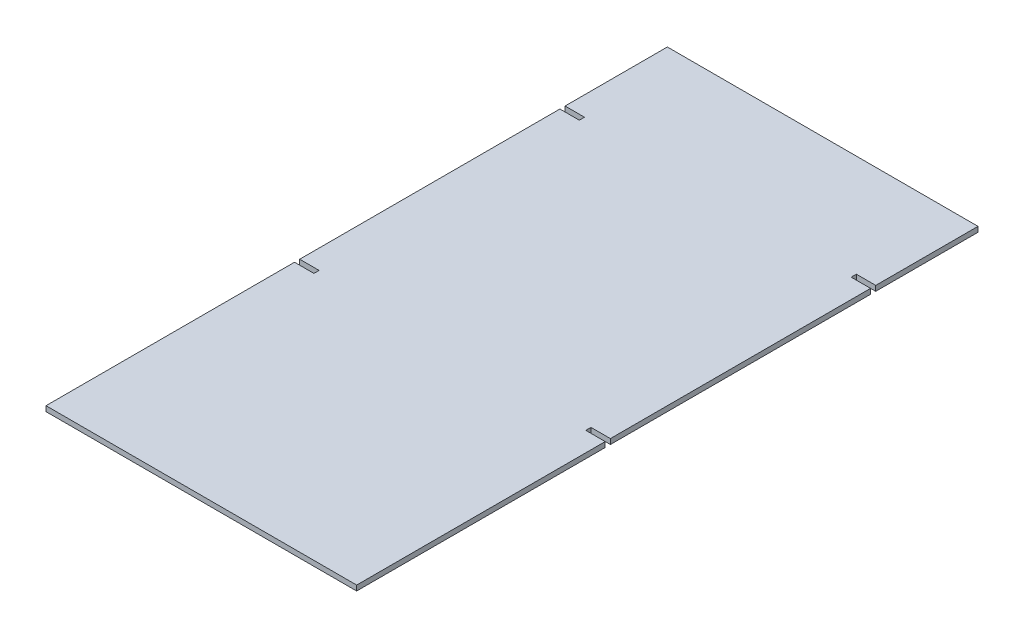
ISO-10303-21;
HEADER;
FILE_DESCRIPTION(('STEP AP214'),'2;1');
FILE_NAME('part.step','',(''),(''),'','','');
FILE_SCHEMA(('AUTOMOTIVE_DESIGN { 1 0 10303 214 1 1 1 1 }'));
ENDSEC;
DATA;
#1=APPLICATION_CONTEXT('core data for automotive mechanical design processes');
#2=APPLICATION_PROTOCOL_DEFINITION('international standard','automotive_design',2000,#1);
#3=PRODUCT_CONTEXT('',#1,'mechanical');
#4=PRODUCT('Part','Part','',(#3));
#5=PRODUCT_RELATED_PRODUCT_CATEGORY('part','',(#4));
#6=PRODUCT_DEFINITION_FORMATION('','',#4);
#7=PRODUCT_DEFINITION_CONTEXT('part definition',#1,'design');
#8=PRODUCT_DEFINITION('design','',#6,#7);
#9=PRODUCT_DEFINITION_SHAPE('','',#8);
#10=(LENGTH_UNIT() NAMED_UNIT(*) SI_UNIT(.MILLI.,.METRE.));
#11=(NAMED_UNIT(*) PLANE_ANGLE_UNIT() SI_UNIT($,.RADIAN.));
#12=(NAMED_UNIT(*) SI_UNIT($,.STERADIAN.) SOLID_ANGLE_UNIT());
#13=UNCERTAINTY_MEASURE_WITH_UNIT(LENGTH_MEASURE(1.E-05),#10,'distance_accuracy_value','');
#14=(GEOMETRIC_REPRESENTATION_CONTEXT(3) GLOBAL_UNCERTAINTY_ASSIGNED_CONTEXT((#13)) GLOBAL_UNIT_ASSIGNED_CONTEXT((#10,
#11,#12)) REPRESENTATION_CONTEXT('',''));
#15=CARTESIAN_POINT('',(0.,0.,0.));
#16=DIRECTION('',(0.,0.,1.));
#17=DIRECTION('',(1.,0.,0.));
#18=AXIS2_PLACEMENT_3D('',#15,#16,#17);
#19=CARTESIAN_POINT('',(152.4,5.08,304.8));
#20=DIRECTION('',(-1.,0.,0.));
#21=DIRECTION('',(0.,0.,1.));
#22=AXIS2_PLACEMENT_3D('',#19,#20,#21);
#23=PLANE('',#22);
#24=DIRECTION('',(0.,0.,-1.));
#25=VECTOR('',#24,1.);
#26=CARTESIAN_POINT('',(152.4,0.,304.8));
#27=LINE('',#26,#25);
#28=CARTESIAN_POINT('',(152.4,0.,55.88));
#29=VERTEX_POINT('',#28);
#30=CARTESIAN_POINT('',(152.4,0.,-199.39));
#31=VERTEX_POINT('',#30);
#32=EDGE_CURVE('E195',#29,#31,#27,.T.);
#33=ORIENTED_EDGE('',*,*,#32,.T.);
#34=DIRECTION('',(0.,1.,0.));
#35=VECTOR('',#34,1.);
#36=CARTESIAN_POINT('',(152.4,0.,-199.39));
#37=LINE('',#36,#35);
#38=CARTESIAN_POINT('',(152.4,5.08,-199.39));
#39=VERTEX_POINT('',#38);
#40=EDGE_CURVE('E299',#31,#39,#37,.T.);
#41=ORIENTED_EDGE('',*,*,#40,.T.);
#42=DIRECTION('',(0.,0.,-1.));
#43=VECTOR('',#42,1.);
#44=CARTESIAN_POINT('',(152.4,5.08,304.8));
#45=LINE('',#44,#43);
#46=CARTESIAN_POINT('',(152.4,5.08,55.88));
#47=VERTEX_POINT('',#46);
#48=EDGE_CURVE('E311',#47,#39,#45,.T.);
#49=ORIENTED_EDGE('',*,*,#48,.F.);
#50=DIRECTION('',(0.,1.,0.));
#51=VECTOR('',#50,1.);
#52=CARTESIAN_POINT('',(152.4,0.,55.88));
#53=LINE('',#52,#51);
#54=EDGE_CURVE('E294',#29,#47,#53,.T.);
#55=ORIENTED_EDGE('',*,*,#54,.F.);
#56=EDGE_LOOP('',(#33,#41,#49,#55));
#57=FACE_BOUND('',#56,.T.);
#58=ADVANCED_FACE('F33',(#57),#23,.F.);
#59=CARTESIAN_POINT('',(152.4,0.,304.8));
#60=VERTEX_POINT('',#59);
#61=CARTESIAN_POINT('',(152.4,0.,60.96));
#62=VERTEX_POINT('',#61);
#63=EDGE_CURVE('E198',#60,#62,#27,.T.);
#64=ORIENTED_EDGE('',*,*,#63,.T.);
#65=DIRECTION('',(0.,1.,0.));
#66=VECTOR('',#65,1.);
#67=CARTESIAN_POINT('',(152.4,0.,60.96));
#68=LINE('',#67,#66);
#69=CARTESIAN_POINT('',(152.4,5.08,60.96));
#70=VERTEX_POINT('',#69);
#71=EDGE_CURVE('E196',#62,#70,#68,.T.);
#72=ORIENTED_EDGE('',*,*,#71,.T.);
#73=CARTESIAN_POINT('',(152.4,5.08,304.8));
#74=VERTEX_POINT('',#73);
#75=EDGE_CURVE('E307',#74,#70,#45,.T.);
#76=ORIENTED_EDGE('',*,*,#75,.F.);
#77=DIRECTION('',(0.,-1.,0.));
#78=VECTOR('',#77,1.);
#79=CARTESIAN_POINT('',(152.4,5.08,304.8));
#80=LINE('',#79,#78);
#81=EDGE_CURVE('E220',#74,#60,#80,.T.);
#82=ORIENTED_EDGE('',*,*,#81,.T.);
#83=EDGE_LOOP('',(#64,#72,#76,#82));
#84=FACE_BOUND('',#83,.T.);
#85=ADVANCED_FACE('F327',(#84),#23,.F.);
#86=CARTESIAN_POINT('',(-152.4,5.08,304.8));
#87=DIRECTION('',(1.,0.,0.));
#88=DIRECTION('',(0.,0.,-1.));
#89=AXIS2_PLACEMENT_3D('',#86,#87,#88);
#90=PLANE('',#89);
#91=DIRECTION('',(0.,0.,1.));
#92=VECTOR('',#91,1.);
#93=CARTESIAN_POINT('',(-152.4,5.08,304.8));
#94=LINE('',#93,#92);
#95=CARTESIAN_POINT('',(-152.4,5.08,60.96));
#96=VERTEX_POINT('',#95);
#97=CARTESIAN_POINT('',(-152.4,5.08,304.8));
#98=VERTEX_POINT('',#97);
#99=EDGE_CURVE('E313',#96,#98,#94,.T.);
#100=ORIENTED_EDGE('',*,*,#99,.F.);
#101=DIRECTION('',(0.,1.,0.));
#102=VECTOR('',#101,1.);
#103=CARTESIAN_POINT('',(-152.4,0.,60.96));
#104=LINE('',#103,#102);
#105=CARTESIAN_POINT('',(-152.4,0.,60.96));
#106=VERTEX_POINT('',#105);
#107=EDGE_CURVE('E250',#106,#96,#104,.T.);
#108=ORIENTED_EDGE('',*,*,#107,.F.);
#109=DIRECTION('',(0.,0.,1.));
#110=VECTOR('',#109,1.);
#111=CARTESIAN_POINT('',(-152.4,0.,304.8));
#112=LINE('',#111,#110);
#113=CARTESIAN_POINT('',(-152.4,0.,304.8));
#114=VERTEX_POINT('',#113);
#115=EDGE_CURVE('E209',#106,#114,#112,.T.);
#116=ORIENTED_EDGE('',*,*,#115,.T.);
#117=DIRECTION('',(0.,-1.,0.));
#118=VECTOR('',#117,1.);
#119=CARTESIAN_POINT('',(-152.4,5.08,304.8));
#120=LINE('',#119,#118);
#121=EDGE_CURVE('E222',#98,#114,#120,.T.);
#122=ORIENTED_EDGE('',*,*,#121,.F.);
#123=EDGE_LOOP('',(#100,#108,#116,#122));
#124=FACE_BOUND('',#123,.T.);
#125=ADVANCED_FACE('F355',(#124),#90,.F.);
#126=CARTESIAN_POINT('',(-152.4,0.,-304.8));
#127=VERTEX_POINT('',#126);
#128=CARTESIAN_POINT('',(-152.4,0.,-204.47));
#129=VERTEX_POINT('',#128);
#130=EDGE_CURVE('E215',#127,#129,#112,.T.);
#131=ORIENTED_EDGE('',*,*,#130,.T.);
#132=DIRECTION('',(0.,1.,0.));
#133=VECTOR('',#132,1.);
#134=CARTESIAN_POINT('',(-152.4,0.,-204.47));
#135=LINE('',#134,#133);
#136=CARTESIAN_POINT('',(-152.4,5.08,-204.47));
#137=VERTEX_POINT('',#136);
#138=EDGE_CURVE('E247',#129,#137,#135,.T.);
#139=ORIENTED_EDGE('',*,*,#138,.T.);
#140=CARTESIAN_POINT('',(-152.4,5.08,-304.8));
#141=VERTEX_POINT('',#140);
#142=EDGE_CURVE('E230',#141,#137,#94,.T.);
#143=ORIENTED_EDGE('',*,*,#142,.F.);
#144=DIRECTION('',(0.,-1.,0.));
#145=VECTOR('',#144,1.);
#146=CARTESIAN_POINT('',(-152.4,5.08,-304.8));
#147=LINE('',#146,#145);
#148=EDGE_CURVE('E41',#141,#127,#147,.T.);
#149=ORIENTED_EDGE('',*,*,#148,.T.);
#150=EDGE_LOOP('',(#131,#139,#143,#149));
#151=FACE_BOUND('',#150,.T.);
#152=ADVANCED_FACE('F227',(#151),#90,.F.);
#153=CARTESIAN_POINT('',(152.4,5.08,-204.47));
#154=VERTEX_POINT('',#153);
#155=CARTESIAN_POINT('',(152.4,5.08,-304.8));
#156=VERTEX_POINT('',#155);
#157=EDGE_CURVE('E188',#154,#156,#45,.T.);
#158=ORIENTED_EDGE('',*,*,#157,.F.);
#159=DIRECTION('',(0.,1.,0.));
#160=VECTOR('',#159,1.);
#161=CARTESIAN_POINT('',(152.4,0.,-204.47));
#162=LINE('',#161,#160);
#163=CARTESIAN_POINT('',(152.4,0.,-204.47));
#164=VERTEX_POINT('',#163);
#165=EDGE_CURVE('E174',#164,#154,#162,.T.);
#166=ORIENTED_EDGE('',*,*,#165,.F.);
#167=CARTESIAN_POINT('',(152.4,0.,-304.8));
#168=VERTEX_POINT('',#167);
#169=EDGE_CURVE('E186',#164,#168,#27,.T.);
#170=ORIENTED_EDGE('',*,*,#169,.T.);
#171=DIRECTION('',(0.,-1.,0.));
#172=VECTOR('',#171,1.);
#173=CARTESIAN_POINT('',(152.4,5.08,-304.8));
#174=LINE('',#173,#172);
#175=EDGE_CURVE('E11',#156,#168,#174,.T.);
#176=ORIENTED_EDGE('',*,*,#175,.F.);
#177=EDGE_LOOP('',(#158,#166,#170,#176));
#178=FACE_BOUND('',#177,.T.);
#179=ADVANCED_FACE('F35',(#178),#23,.F.);
#180=CARTESIAN_POINT('',(152.4,5.08,-304.8));
#181=DIRECTION('',(0.,0.,1.));
#182=DIRECTION('',(1.,0.,0.));
#183=AXIS2_PLACEMENT_3D('',#180,#181,#182);
#184=PLANE('',#183);
#185=DIRECTION('',(-1.,0.,0.));
#186=VECTOR('',#185,1.);
#187=CARTESIAN_POINT('',(152.4,0.,-304.8));
#188=LINE('',#187,#186);
#189=EDGE_CURVE('E194',#168,#127,#188,.T.);
#190=ORIENTED_EDGE('',*,*,#189,.T.);
#191=ORIENTED_EDGE('',*,*,#148,.F.);
#192=DIRECTION('',(-1.,0.,0.));
#193=VECTOR('',#192,1.);
#194=CARTESIAN_POINT('',(152.4,5.08,-304.8));
#195=LINE('',#194,#193);
#196=EDGE_CURVE('E310',#156,#141,#195,.T.);
#197=ORIENTED_EDGE('',*,*,#196,.F.);
#198=ORIENTED_EDGE('',*,*,#175,.T.);
#199=EDGE_LOOP('',(#190,#191,#197,#198));
#200=FACE_BOUND('',#199,.T.);
#201=ADVANCED_FACE('F346',(#200),#184,.F.);
#202=CARTESIAN_POINT('',(-152.4,0.,-199.39));
#203=VERTEX_POINT('',#202);
#204=CARTESIAN_POINT('',(-152.4,0.,55.88));
#205=VERTEX_POINT('',#204);
#206=EDGE_CURVE('E213',#203,#205,#112,.T.);
#207=ORIENTED_EDGE('',*,*,#206,.T.);
#208=DIRECTION('',(0.,1.,0.));
#209=VECTOR('',#208,1.);
#210=CARTESIAN_POINT('',(-152.4,0.,55.88));
#211=LINE('',#210,#209);
#212=CARTESIAN_POINT('',(-152.4,5.08,55.88));
#213=VERTEX_POINT('',#212);
#214=EDGE_CURVE('E278',#205,#213,#211,.T.);
#215=ORIENTED_EDGE('',*,*,#214,.T.);
#216=CARTESIAN_POINT('',(-152.4,5.08,-199.39));
#217=VERTEX_POINT('',#216);
#218=EDGE_CURVE('E314',#217,#213,#94,.T.);
#219=ORIENTED_EDGE('',*,*,#218,.F.);
#220=DIRECTION('',(0.,1.,0.));
#221=VECTOR('',#220,1.);
#222=CARTESIAN_POINT('',(-152.4,0.,-199.39));
#223=LINE('',#222,#221);
#224=EDGE_CURVE('E258',#203,#217,#223,.T.);
#225=ORIENTED_EDGE('',*,*,#224,.F.);
#226=EDGE_LOOP('',(#207,#215,#219,#225));
#227=FACE_BOUND('',#226,.T.);
#228=ADVANCED_FACE('F348',(#227),#90,.F.);
#229=CARTESIAN_POINT('',(152.4,5.08,304.8));
#230=DIRECTION('',(0.,0.,-1.));
#231=DIRECTION('',(-1.,0.,0.));
#232=AXIS2_PLACEMENT_3D('',#229,#230,#231);
#233=PLANE('',#232);
#234=DIRECTION('',(1.,0.,0.));
#235=VECTOR('',#234,1.);
#236=CARTESIAN_POINT('',(152.4,0.,304.8));
#237=LINE('',#236,#235);
#238=EDGE_CURVE('E218',#114,#60,#237,.T.);
#239=ORIENTED_EDGE('',*,*,#238,.T.);
#240=ORIENTED_EDGE('',*,*,#81,.F.);
#241=DIRECTION('',(1.,0.,0.));
#242=VECTOR('',#241,1.);
#243=CARTESIAN_POINT('',(152.4,5.08,304.8));
#244=LINE('',#243,#242);
#245=EDGE_CURVE('E223',#98,#74,#244,.T.);
#246=ORIENTED_EDGE('',*,*,#245,.F.);
#247=ORIENTED_EDGE('',*,*,#121,.T.);
#248=EDGE_LOOP('',(#239,#240,#246,#247));
#249=FACE_BOUND('',#248,.T.);
#250=ADVANCED_FACE('F325',(#249),#233,.F.);
#251=CARTESIAN_POINT('',(0.,5.08,0.));
#252=DIRECTION('',(0.,1.,0.));
#253=DIRECTION('',(0.,0.,1.));
#254=AXIS2_PLACEMENT_3D('',#251,#252,#253);
#255=PLANE('',#254);
#256=DIRECTION('',(1.,0.,0.));
#257=VECTOR('',#256,1.);
#258=CARTESIAN_POINT('',(-152.4,5.08,60.96));
#259=LINE('',#258,#257);
#260=CARTESIAN_POINT('',(-133.35,5.08,60.96));
#261=VERTEX_POINT('',#260);
#262=EDGE_CURVE('E270',#96,#261,#259,.T.);
#263=ORIENTED_EDGE('',*,*,#262,.F.);
#264=ORIENTED_EDGE('',*,*,#99,.T.);
#265=ORIENTED_EDGE('',*,*,#245,.T.);
#266=ORIENTED_EDGE('',*,*,#75,.T.);
#267=DIRECTION('',(1.,0.,0.));
#268=VECTOR('',#267,1.);
#269=CARTESIAN_POINT('',(152.4,5.08,60.96));
#270=LINE('',#269,#268);
#271=CARTESIAN_POINT('',(133.35,5.08,60.96));
#272=VERTEX_POINT('',#271);
#273=EDGE_CURVE('E288',#272,#70,#270,.T.);
#274=ORIENTED_EDGE('',*,*,#273,.F.);
#275=DIRECTION('',(0.,0.,1.));
#276=VECTOR('',#275,1.);
#277=CARTESIAN_POINT('',(133.35,5.08,60.96));
#278=LINE('',#277,#276);
#279=CARTESIAN_POINT('',(133.35,5.08,55.88));
#280=VERTEX_POINT('',#279);
#281=EDGE_CURVE('E298',#280,#272,#278,.T.);
#282=ORIENTED_EDGE('',*,*,#281,.F.);
#283=DIRECTION('',(-1.,0.,0.));
#284=VECTOR('',#283,1.);
#285=CARTESIAN_POINT('',(152.4,5.08,55.88));
#286=LINE('',#285,#284);
#287=EDGE_CURVE('E295',#47,#280,#286,.T.);
#288=ORIENTED_EDGE('',*,*,#287,.F.);
#289=ORIENTED_EDGE('',*,*,#48,.T.);
#290=DIRECTION('',(1.,0.,0.));
#291=VECTOR('',#290,1.);
#292=CARTESIAN_POINT('',(152.4,5.08,-199.39));
#293=LINE('',#292,#291);
#294=CARTESIAN_POINT('',(133.35,5.08,-199.39));
#295=VERTEX_POINT('',#294);
#296=EDGE_CURVE('E181',#295,#39,#293,.T.);
#297=ORIENTED_EDGE('',*,*,#296,.F.);
#298=DIRECTION('',(0.,0.,1.));
#299=VECTOR('',#298,1.);
#300=CARTESIAN_POINT('',(133.35,5.08,-204.47));
#301=LINE('',#300,#299);
#302=CARTESIAN_POINT('',(133.35,5.08,-204.47));
#303=VERTEX_POINT('',#302);
#304=EDGE_CURVE('E416',#303,#295,#301,.T.);
#305=ORIENTED_EDGE('',*,*,#304,.F.);
#306=DIRECTION('',(-1.,0.,0.));
#307=VECTOR('',#306,1.);
#308=CARTESIAN_POINT('',(152.4,5.08,-204.47));
#309=LINE('',#308,#307);
#310=EDGE_CURVE('E255',#154,#303,#309,.T.);
#311=ORIENTED_EDGE('',*,*,#310,.F.);
#312=ORIENTED_EDGE('',*,*,#157,.T.);
#313=ORIENTED_EDGE('',*,*,#196,.T.);
#314=ORIENTED_EDGE('',*,*,#142,.T.);
#315=DIRECTION('',(-1.,0.,0.));
#316=VECTOR('',#315,1.);
#317=CARTESIAN_POINT('',(-152.4,5.08,-204.47));
#318=LINE('',#317,#316);
#319=CARTESIAN_POINT('',(-133.35,5.08,-204.47));
#320=VERTEX_POINT('',#319);
#321=EDGE_CURVE('E248',#320,#137,#318,.T.);
#322=ORIENTED_EDGE('',*,*,#321,.F.);
#323=DIRECTION('',(0.,0.,-1.));
#324=VECTOR('',#323,1.);
#325=CARTESIAN_POINT('',(-133.35,5.08,-204.47));
#326=LINE('',#325,#324);
#327=CARTESIAN_POINT('',(-133.35,5.08,-199.39));
#328=VERTEX_POINT('',#327);
#329=EDGE_CURVE('E238',#328,#320,#326,.T.);
#330=ORIENTED_EDGE('',*,*,#329,.F.);
#331=DIRECTION('',(1.,0.,0.));
#332=VECTOR('',#331,1.);
#333=CARTESIAN_POINT('',(-152.4,5.08,-199.39));
#334=LINE('',#333,#332);
#335=EDGE_CURVE('E242',#217,#328,#334,.T.);
#336=ORIENTED_EDGE('',*,*,#335,.F.);
#337=ORIENTED_EDGE('',*,*,#218,.T.);
#338=DIRECTION('',(-1.,0.,0.));
#339=VECTOR('',#338,1.);
#340=CARTESIAN_POINT('',(-152.4,5.08,55.88));
#341=LINE('',#340,#339);
#342=CARTESIAN_POINT('',(-133.35,5.08,55.88));
#343=VERTEX_POINT('',#342);
#344=EDGE_CURVE('E265',#343,#213,#341,.T.);
#345=ORIENTED_EDGE('',*,*,#344,.F.);
#346=DIRECTION('',(0.,0.,-1.));
#347=VECTOR('',#346,1.);
#348=CARTESIAN_POINT('',(-133.35,5.08,60.96));
#349=LINE('',#348,#347);
#350=EDGE_CURVE('E273',#261,#343,#349,.T.);
#351=ORIENTED_EDGE('',*,*,#350,.F.);
#352=EDGE_LOOP('',(#263,#264,#265,#266,#274,#282,#288,#289,#297,#305,#311,#312,#313,#314,#322,
#330,#336,#337,#345,#351));
#353=FACE_BOUND('',#352,.T.);
#354=ADVANCED_FACE('F319',(#353),#255,.T.);
#355=CARTESIAN_POINT('',(0.,0.,0.));
#356=DIRECTION('',(0.,1.,0.));
#357=DIRECTION('',(0.,0.,1.));
#358=AXIS2_PLACEMENT_3D('',#355,#356,#357);
#359=PLANE('',#358);
#360=ORIENTED_EDGE('',*,*,#115,.F.);
#361=DIRECTION('',(1.,0.,0.));
#362=VECTOR('',#361,1.);
#363=CARTESIAN_POINT('',(-152.4,0.,60.96));
#364=LINE('',#363,#362);
#365=CARTESIAN_POINT('',(-133.35,0.,60.96));
#366=VERTEX_POINT('',#365);
#367=EDGE_CURVE('E261',#106,#366,#364,.T.);
#368=ORIENTED_EDGE('',*,*,#367,.T.);
#369=DIRECTION('',(0.,0.,-1.));
#370=VECTOR('',#369,1.);
#371=CARTESIAN_POINT('',(-133.35,0.,60.96));
#372=LINE('',#371,#370);
#373=CARTESIAN_POINT('',(-133.35,0.,55.88));
#374=VERTEX_POINT('',#373);
#375=EDGE_CURVE('E264',#366,#374,#372,.T.);
#376=ORIENTED_EDGE('',*,*,#375,.T.);
#377=DIRECTION('',(-1.,0.,0.));
#378=VECTOR('',#377,1.);
#379=CARTESIAN_POINT('',(-152.4,0.,55.88));
#380=LINE('',#379,#378);
#381=EDGE_CURVE('E48',#374,#205,#380,.T.);
#382=ORIENTED_EDGE('',*,*,#381,.T.);
#383=ORIENTED_EDGE('',*,*,#206,.F.);
#384=DIRECTION('',(1.,0.,0.));
#385=VECTOR('',#384,1.);
#386=CARTESIAN_POINT('',(-152.4,0.,-199.39));
#387=LINE('',#386,#385);
#388=CARTESIAN_POINT('',(-133.35,0.,-199.39));
#389=VERTEX_POINT('',#388);
#390=EDGE_CURVE('E237',#203,#389,#387,.T.);
#391=ORIENTED_EDGE('',*,*,#390,.T.);
#392=DIRECTION('',(0.,0.,-1.));
#393=VECTOR('',#392,1.);
#394=CARTESIAN_POINT('',(-133.35,0.,-204.47));
#395=LINE('',#394,#393);
#396=CARTESIAN_POINT('',(-133.35,0.,-204.47));
#397=VERTEX_POINT('',#396);
#398=EDGE_CURVE('E56',#389,#397,#395,.T.);
#399=ORIENTED_EDGE('',*,*,#398,.T.);
#400=DIRECTION('',(-1.,0.,0.));
#401=VECTOR('',#400,1.);
#402=CARTESIAN_POINT('',(-152.4,0.,-204.47));
#403=LINE('',#402,#401);
#404=EDGE_CURVE('E234',#397,#129,#403,.T.);
#405=ORIENTED_EDGE('',*,*,#404,.T.);
#406=ORIENTED_EDGE('',*,*,#130,.F.);
#407=ORIENTED_EDGE('',*,*,#189,.F.);
#408=ORIENTED_EDGE('',*,*,#169,.F.);
#409=DIRECTION('',(-1.,0.,0.));
#410=VECTOR('',#409,1.);
#411=CARTESIAN_POINT('',(152.4,0.,-204.47));
#412=LINE('',#411,#410);
#413=CARTESIAN_POINT('',(133.35,0.,-204.47));
#414=VERTEX_POINT('',#413);
#415=EDGE_CURVE('E170',#164,#414,#412,.T.);
#416=ORIENTED_EDGE('',*,*,#415,.T.);
#417=DIRECTION('',(0.,0.,1.));
#418=VECTOR('',#417,1.);
#419=CARTESIAN_POINT('',(133.35,0.,-204.47));
#420=LINE('',#419,#418);
#421=CARTESIAN_POINT('',(133.35,0.,-199.39));
#422=VERTEX_POINT('',#421);
#423=EDGE_CURVE('E180',#414,#422,#420,.T.);
#424=ORIENTED_EDGE('',*,*,#423,.T.);
#425=DIRECTION('',(1.,0.,0.));
#426=VECTOR('',#425,1.);
#427=CARTESIAN_POINT('',(152.4,0.,-199.39));
#428=LINE('',#427,#426);
#429=EDGE_CURVE('E189',#422,#31,#428,.T.);
#430=ORIENTED_EDGE('',*,*,#429,.T.);
#431=ORIENTED_EDGE('',*,*,#32,.F.);
#432=DIRECTION('',(-1.,0.,0.));
#433=VECTOR('',#432,1.);
#434=CARTESIAN_POINT('',(152.4,0.,55.88));
#435=LINE('',#434,#433);
#436=CARTESIAN_POINT('',(133.35,0.,55.88));
#437=VERTEX_POINT('',#436);
#438=EDGE_CURVE('E284',#29,#437,#435,.T.);
#439=ORIENTED_EDGE('',*,*,#438,.T.);
#440=DIRECTION('',(0.,0.,1.));
#441=VECTOR('',#440,1.);
#442=CARTESIAN_POINT('',(133.35,0.,60.96));
#443=LINE('',#442,#441);
#444=CARTESIAN_POINT('',(133.35,0.,60.96));
#445=VERTEX_POINT('',#444);
#446=EDGE_CURVE('E287',#437,#445,#443,.T.);
#447=ORIENTED_EDGE('',*,*,#446,.T.);
#448=DIRECTION('',(1.,0.,0.));
#449=VECTOR('',#448,1.);
#450=CARTESIAN_POINT('',(152.4,0.,60.96));
#451=LINE('',#450,#449);
#452=EDGE_CURVE('E291',#445,#62,#451,.T.);
#453=ORIENTED_EDGE('',*,*,#452,.T.);
#454=ORIENTED_EDGE('',*,*,#63,.F.);
#455=ORIENTED_EDGE('',*,*,#238,.F.);
#456=EDGE_LOOP('',(#360,#368,#376,#382,#383,#391,#399,#405,#406,#407,#408,#416,#424,#430,#431,
#439,#447,#453,#454,#455));
#457=FACE_BOUND('',#456,.T.);
#458=ADVANCED_FACE('F192',(#457),#359,.F.);
#459=CARTESIAN_POINT('',(152.4,0.,60.96));
#460=DIRECTION('',(0.,0.,1.));
#461=DIRECTION('',(1.,0.,0.));
#462=AXIS2_PLACEMENT_3D('',#459,#460,#461);
#463=PLANE('',#462);
#464=ORIENTED_EDGE('',*,*,#273,.T.);
#465=ORIENTED_EDGE('',*,*,#71,.F.);
#466=ORIENTED_EDGE('',*,*,#452,.F.);
#467=DIRECTION('',(0.,1.,0.));
#468=VECTOR('',#467,1.);
#469=CARTESIAN_POINT('',(133.35,0.,60.96));
#470=LINE('',#469,#468);
#471=EDGE_CURVE('E201',#445,#272,#470,.T.);
#472=ORIENTED_EDGE('',*,*,#471,.T.);
#473=EDGE_LOOP('',(#464,#465,#466,#472));
#474=FACE_BOUND('',#473,.T.);
#475=ADVANCED_FACE('F330',(#474),#463,.F.);
#476=CARTESIAN_POINT('',(133.35,0.,60.96));
#477=DIRECTION('',(-1.,0.,0.));
#478=DIRECTION('',(0.,0.,1.));
#479=AXIS2_PLACEMENT_3D('',#476,#477,#478);
#480=PLANE('',#479);
#481=ORIENTED_EDGE('',*,*,#281,.T.);
#482=ORIENTED_EDGE('',*,*,#471,.F.);
#483=ORIENTED_EDGE('',*,*,#446,.F.);
#484=DIRECTION('',(0.,1.,0.));
#485=VECTOR('',#484,1.);
#486=CARTESIAN_POINT('',(133.35,0.,55.88));
#487=LINE('',#486,#485);
#488=EDGE_CURVE('E304',#437,#280,#487,.T.);
#489=ORIENTED_EDGE('',*,*,#488,.T.);
#490=EDGE_LOOP('',(#481,#482,#483,#489));
#491=FACE_BOUND('',#490,.T.);
#492=ADVANCED_FACE('F334',(#491),#480,.F.);
#493=CARTESIAN_POINT('',(152.4,0.,55.88));
#494=DIRECTION('',(0.,0.,-1.));
#495=DIRECTION('',(-1.,0.,0.));
#496=AXIS2_PLACEMENT_3D('',#493,#494,#495);
#497=PLANE('',#496);
#498=ORIENTED_EDGE('',*,*,#287,.T.);
#499=ORIENTED_EDGE('',*,*,#488,.F.);
#500=ORIENTED_EDGE('',*,*,#438,.F.);
#501=ORIENTED_EDGE('',*,*,#54,.T.);
#502=EDGE_LOOP('',(#498,#499,#500,#501));
#503=FACE_BOUND('',#502,.T.);
#504=ADVANCED_FACE('F336',(#503),#497,.F.);
#505=CARTESIAN_POINT('',(152.4,0.,-199.39));
#506=DIRECTION('',(0.,0.,1.));
#507=DIRECTION('',(1.,0.,0.));
#508=AXIS2_PLACEMENT_3D('',#505,#506,#507);
#509=PLANE('',#508);
#510=ORIENTED_EDGE('',*,*,#296,.T.);
#511=ORIENTED_EDGE('',*,*,#40,.F.);
#512=ORIENTED_EDGE('',*,*,#429,.F.);
#513=DIRECTION('',(0.,1.,0.));
#514=VECTOR('',#513,1.);
#515=CARTESIAN_POINT('',(133.35,0.,-199.39));
#516=LINE('',#515,#514);
#517=EDGE_CURVE('E414',#422,#295,#516,.T.);
#518=ORIENTED_EDGE('',*,*,#517,.T.);
#519=EDGE_LOOP('',(#510,#511,#512,#518));
#520=FACE_BOUND('',#519,.T.);
#521=ADVANCED_FACE('F376',(#520),#509,.F.);
#522=CARTESIAN_POINT('',(133.35,0.,-204.47));
#523=DIRECTION('',(-1.,0.,0.));
#524=DIRECTION('',(0.,0.,1.));
#525=AXIS2_PLACEMENT_3D('',#522,#523,#524);
#526=PLANE('',#525);
#527=ORIENTED_EDGE('',*,*,#304,.T.);
#528=ORIENTED_EDGE('',*,*,#517,.F.);
#529=ORIENTED_EDGE('',*,*,#423,.F.);
#530=DIRECTION('',(0.,1.,0.));
#531=VECTOR('',#530,1.);
#532=CARTESIAN_POINT('',(133.35,0.,-204.47));
#533=LINE('',#532,#531);
#534=EDGE_CURVE('E176',#414,#303,#533,.T.);
#535=ORIENTED_EDGE('',*,*,#534,.T.);
#536=EDGE_LOOP('',(#527,#528,#529,#535));
#537=FACE_BOUND('',#536,.T.);
#538=ADVANCED_FACE('F404',(#537),#526,.F.);
#539=CARTESIAN_POINT('',(152.4,0.,-204.47));
#540=DIRECTION('',(0.,0.,-1.));
#541=DIRECTION('',(-1.,0.,0.));
#542=AXIS2_PLACEMENT_3D('',#539,#540,#541);
#543=PLANE('',#542);
#544=ORIENTED_EDGE('',*,*,#310,.T.);
#545=ORIENTED_EDGE('',*,*,#534,.F.);
#546=ORIENTED_EDGE('',*,*,#415,.F.);
#547=ORIENTED_EDGE('',*,*,#165,.T.);
#548=EDGE_LOOP('',(#544,#545,#546,#547));
#549=FACE_BOUND('',#548,.T.);
#550=ADVANCED_FACE('F173',(#549),#543,.F.);
#551=CARTESIAN_POINT('',(-152.4,0.,-204.47));
#552=DIRECTION('',(0.,0.,-1.));
#553=DIRECTION('',(-1.,0.,0.));
#554=AXIS2_PLACEMENT_3D('',#551,#552,#553);
#555=PLANE('',#554);
#556=ORIENTED_EDGE('',*,*,#321,.T.);
#557=ORIENTED_EDGE('',*,*,#138,.F.);
#558=ORIENTED_EDGE('',*,*,#404,.F.);
#559=DIRECTION('',(0.,1.,0.));
#560=VECTOR('',#559,1.);
#561=CARTESIAN_POINT('',(-133.35,0.,-204.47));
#562=LINE('',#561,#560);
#563=EDGE_CURVE('E253',#397,#320,#562,.T.);
#564=ORIENTED_EDGE('',*,*,#563,.T.);
#565=EDGE_LOOP('',(#556,#557,#558,#564));
#566=FACE_BOUND('',#565,.T.);
#567=ADVANCED_FACE('F393',(#566),#555,.F.);
#568=CARTESIAN_POINT('',(-133.35,0.,-204.47));
#569=DIRECTION('',(1.,0.,0.));
#570=DIRECTION('',(0.,0.,-1.));
#571=AXIS2_PLACEMENT_3D('',#568,#569,#570);
#572=PLANE('',#571);
#573=ORIENTED_EDGE('',*,*,#329,.T.);
#574=ORIENTED_EDGE('',*,*,#563,.F.);
#575=ORIENTED_EDGE('',*,*,#398,.F.);
#576=DIRECTION('',(0.,1.,0.));
#577=VECTOR('',#576,1.);
#578=CARTESIAN_POINT('',(-133.35,0.,-199.39));
#579=LINE('',#578,#577);
#580=EDGE_CURVE('E256',#389,#328,#579,.T.);
#581=ORIENTED_EDGE('',*,*,#580,.T.);
#582=EDGE_LOOP('',(#573,#574,#575,#581));
#583=FACE_BOUND('',#582,.T.);
#584=ADVANCED_FACE('F396',(#583),#572,.F.);
#585=CARTESIAN_POINT('',(-152.4,0.,-199.39));
#586=DIRECTION('',(0.,0.,1.));
#587=DIRECTION('',(1.,0.,0.));
#588=AXIS2_PLACEMENT_3D('',#585,#586,#587);
#589=PLANE('',#588);
#590=ORIENTED_EDGE('',*,*,#335,.T.);
#591=ORIENTED_EDGE('',*,*,#580,.F.);
#592=ORIENTED_EDGE('',*,*,#390,.F.);
#593=ORIENTED_EDGE('',*,*,#224,.T.);
#594=EDGE_LOOP('',(#590,#591,#592,#593));
#595=FACE_BOUND('',#594,.T.);
#596=ADVANCED_FACE('F385',(#595),#589,.F.);
#597=CARTESIAN_POINT('',(-152.4,0.,60.96));
#598=DIRECTION('',(0.,0.,1.));
#599=DIRECTION('',(1.,0.,0.));
#600=AXIS2_PLACEMENT_3D('',#597,#598,#599);
#601=PLANE('',#600);
#602=ORIENTED_EDGE('',*,*,#262,.T.);
#603=DIRECTION('',(0.,1.,0.));
#604=VECTOR('',#603,1.);
#605=CARTESIAN_POINT('',(-133.35,0.,60.96));
#606=LINE('',#605,#604);
#607=EDGE_CURVE('E269',#366,#261,#606,.T.);
#608=ORIENTED_EDGE('',*,*,#607,.F.);
#609=ORIENTED_EDGE('',*,*,#367,.F.);
#610=ORIENTED_EDGE('',*,*,#107,.T.);
#611=EDGE_LOOP('',(#602,#608,#609,#610));
#612=FACE_BOUND('',#611,.T.);
#613=ADVANCED_FACE('F381',(#612),#601,.F.);
#614=CARTESIAN_POINT('',(-152.4,0.,55.88));
#615=DIRECTION('',(0.,0.,-1.));
#616=DIRECTION('',(-1.,0.,0.));
#617=AXIS2_PLACEMENT_3D('',#614,#615,#616);
#618=PLANE('',#617);
#619=ORIENTED_EDGE('',*,*,#344,.T.);
#620=ORIENTED_EDGE('',*,*,#214,.F.);
#621=ORIENTED_EDGE('',*,*,#381,.F.);
#622=DIRECTION('',(0.,1.,0.));
#623=VECTOR('',#622,1.);
#624=CARTESIAN_POINT('',(-133.35,0.,55.88));
#625=LINE('',#624,#623);
#626=EDGE_CURVE('E281',#374,#343,#625,.T.);
#627=ORIENTED_EDGE('',*,*,#626,.T.);
#628=EDGE_LOOP('',(#619,#620,#621,#627));
#629=FACE_BOUND('',#628,.T.);
#630=ADVANCED_FACE('F384',(#629),#618,.F.);
#631=CARTESIAN_POINT('',(-133.35,0.,60.96));
#632=DIRECTION('',(1.,0.,0.));
#633=DIRECTION('',(0.,0.,-1.));
#634=AXIS2_PLACEMENT_3D('',#631,#632,#633);
#635=PLANE('',#634);
#636=ORIENTED_EDGE('',*,*,#350,.T.);
#637=ORIENTED_EDGE('',*,*,#626,.F.);
#638=ORIENTED_EDGE('',*,*,#375,.F.);
#639=ORIENTED_EDGE('',*,*,#607,.T.);
#640=EDGE_LOOP('',(#636,#637,#638,#639));
#641=FACE_BOUND('',#640,.T.);
#642=ADVANCED_FACE('F387',(#641),#635,.F.);
#643=CLOSED_SHELL('',(#58,#85,#125,#152,#179,#201,#228,#250,#354,#458,#475,#492,#504,#521,#538,
#550,#567,#584,#596,#613,#630,#642));
#644=MANIFOLD_SOLID_BREP('B2',#643);
#645=ADVANCED_BREP_SHAPE_REPRESENTATION('',(#18,#644),#14);
#646=SHAPE_DEFINITION_REPRESENTATION(#9,#645);
ENDSEC;
END-ISO-10303-21;
